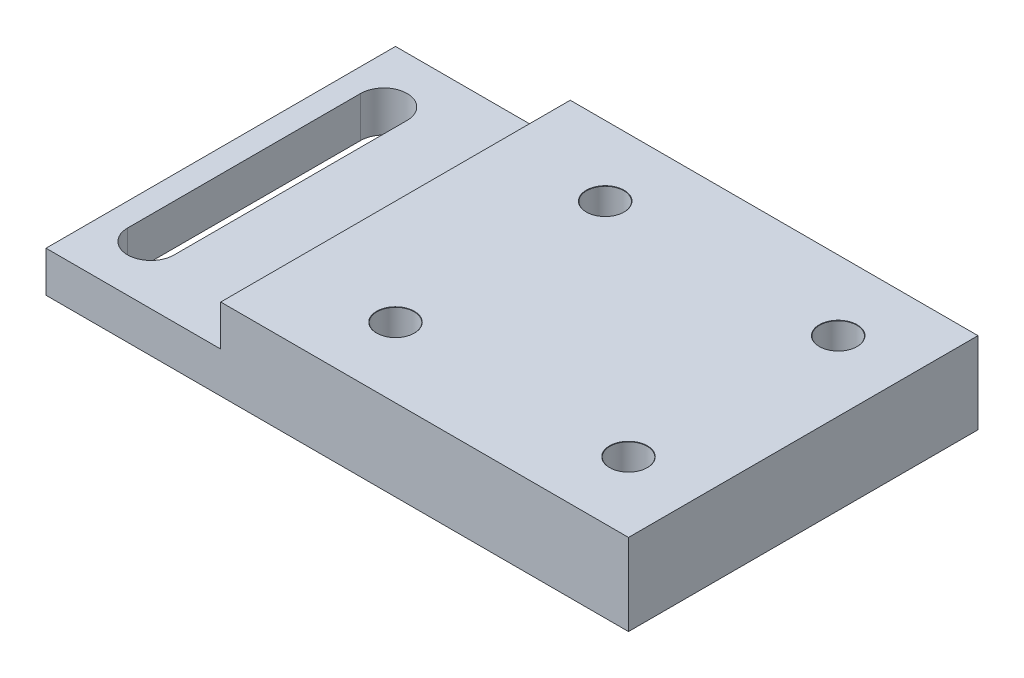
ISO-10303-21;
HEADER;
FILE_DESCRIPTION(('STEP AP214'),'2;1');
FILE_NAME('part.step','',(''),(''),'','','');
FILE_SCHEMA(('AUTOMOTIVE_DESIGN { 1 0 10303 214 1 1 1 1 }'));
ENDSEC;
DATA;
#1=APPLICATION_CONTEXT('core data for automotive mechanical design processes');
#2=APPLICATION_PROTOCOL_DEFINITION('international standard','automotive_design',2000,#1);
#3=PRODUCT_CONTEXT('',#1,'mechanical');
#4=PRODUCT('Part','Part','',(#3));
#5=PRODUCT_RELATED_PRODUCT_CATEGORY('part','',(#4));
#6=PRODUCT_DEFINITION_FORMATION('','',#4);
#7=PRODUCT_DEFINITION_CONTEXT('part definition',#1,'design');
#8=PRODUCT_DEFINITION('design','',#6,#7);
#9=PRODUCT_DEFINITION_SHAPE('','',#8);
#10=(LENGTH_UNIT() NAMED_UNIT(*) SI_UNIT(.MILLI.,.METRE.));
#11=(NAMED_UNIT(*) PLANE_ANGLE_UNIT() SI_UNIT($,.RADIAN.));
#12=(NAMED_UNIT(*) SI_UNIT($,.STERADIAN.) SOLID_ANGLE_UNIT());
#13=UNCERTAINTY_MEASURE_WITH_UNIT(LENGTH_MEASURE(1.E-05),#10,'distance_accuracy_value','');
#14=(GEOMETRIC_REPRESENTATION_CONTEXT(3) GLOBAL_UNCERTAINTY_ASSIGNED_CONTEXT((#13)) GLOBAL_UNIT_ASSIGNED_CONTEXT((#10,
#11,#12)) REPRESENTATION_CONTEXT('',''));
#15=CARTESIAN_POINT('',(0.,0.,0.));
#16=DIRECTION('',(0.,0.,1.));
#17=DIRECTION('',(1.,0.,0.));
#18=AXIS2_PLACEMENT_3D('',#15,#16,#17);
#19=CARTESIAN_POINT('',(25.,7.,15.));
#20=DIRECTION('',(-1.,0.,0.));
#21=DIRECTION('',(0.,0.,1.));
#22=AXIS2_PLACEMENT_3D('',#19,#20,#21);
#23=PLANE('',#22);
#24=DIRECTION('',(0.,0.,-1.));
#25=VECTOR('',#24,1.);
#26=CARTESIAN_POINT('',(25.,0.,15.));
#27=LINE('',#26,#25);
#28=CARTESIAN_POINT('',(25.,0.,15.));
#29=VERTEX_POINT('',#28);
#30=CARTESIAN_POINT('',(25.,0.,-15.));
#31=VERTEX_POINT('',#30);
#32=EDGE_CURVE('E188',#29,#31,#27,.T.);
#33=ORIENTED_EDGE('',*,*,#32,.T.);
#34=DIRECTION('',(0.,-1.,0.));
#35=VECTOR('',#34,1.);
#36=CARTESIAN_POINT('',(25.,7.,-15.));
#37=LINE('',#36,#35);
#38=CARTESIAN_POINT('',(25.,7.,-15.));
#39=VERTEX_POINT('',#38);
#40=EDGE_CURVE('E11',#39,#31,#37,.T.);
#41=ORIENTED_EDGE('',*,*,#40,.F.);
#42=DIRECTION('',(0.,0.,-1.));
#43=VECTOR('',#42,1.);
#44=CARTESIAN_POINT('',(25.,7.,15.));
#45=LINE('',#44,#43);
#46=CARTESIAN_POINT('',(25.,7.,15.));
#47=VERTEX_POINT('',#46);
#48=EDGE_CURVE('E191',#47,#39,#45,.T.);
#49=ORIENTED_EDGE('',*,*,#48,.F.);
#50=DIRECTION('',(0.,-1.,0.));
#51=VECTOR('',#50,1.);
#52=CARTESIAN_POINT('',(25.,7.,15.));
#53=LINE('',#52,#51);
#54=EDGE_CURVE('E203',#47,#29,#53,.T.);
#55=ORIENTED_EDGE('',*,*,#54,.T.);
#56=EDGE_LOOP('',(#33,#41,#49,#55));
#57=FACE_BOUND('',#56,.T.);
#58=ADVANCED_FACE('F38',(#57),#23,.F.);
#59=CARTESIAN_POINT('',(-25.,7.,-15.));
#60=DIRECTION('',(0.,0.,1.));
#61=DIRECTION('',(1.,0.,0.));
#62=AXIS2_PLACEMENT_3D('',#59,#60,#61);
#63=PLANE('',#62);
#64=DIRECTION('',(-1.,0.,0.));
#65=VECTOR('',#64,1.);
#66=CARTESIAN_POINT('',(-25.,3.5,-15.));
#67=LINE('',#66,#65);
#68=CARTESIAN_POINT('',(-10.,3.5,-15.));
#69=VERTEX_POINT('',#68);
#70=CARTESIAN_POINT('',(-25.,3.5,-15.));
#71=VERTEX_POINT('',#70);
#72=EDGE_CURVE('E178',#69,#71,#67,.T.);
#73=ORIENTED_EDGE('',*,*,#72,.F.);
#74=DIRECTION('',(0.,1.,0.));
#75=VECTOR('',#74,1.);
#76=CARTESIAN_POINT('',(-10.,3.5,-15.));
#77=LINE('',#76,#75);
#78=CARTESIAN_POINT('',(-10.,7.,-15.));
#79=VERTEX_POINT('',#78);
#80=EDGE_CURVE('E184',#69,#79,#77,.T.);
#81=ORIENTED_EDGE('',*,*,#80,.T.);
#82=DIRECTION('',(-1.,0.,0.));
#83=VECTOR('',#82,1.);
#84=CARTESIAN_POINT('',(-25.,7.,-15.));
#85=LINE('',#84,#83);
#86=EDGE_CURVE('E195',#39,#79,#85,.T.);
#87=ORIENTED_EDGE('',*,*,#86,.F.);
#88=ORIENTED_EDGE('',*,*,#40,.T.);
#89=DIRECTION('',(-1.,0.,0.));
#90=VECTOR('',#89,1.);
#91=CARTESIAN_POINT('',(-25.,0.,-15.));
#92=LINE('',#91,#90);
#93=CARTESIAN_POINT('',(-25.,0.,-15.));
#94=VERTEX_POINT('',#93);
#95=EDGE_CURVE('E207',#31,#94,#92,.T.);
#96=ORIENTED_EDGE('',*,*,#95,.T.);
#97=DIRECTION('',(0.,-1.,0.));
#98=VECTOR('',#97,1.);
#99=CARTESIAN_POINT('',(-25.,7.,-15.));
#100=LINE('',#99,#98);
#101=EDGE_CURVE('E46',#71,#94,#100,.T.);
#102=ORIENTED_EDGE('',*,*,#101,.F.);
#103=EDGE_LOOP('',(#73,#81,#87,#88,#96,#102));
#104=FACE_BOUND('',#103,.T.);
#105=ADVANCED_FACE('F232',(#104),#63,.F.);
#106=CARTESIAN_POINT('',(-25.,7.,15.));
#107=DIRECTION('',(1.,0.,0.));
#108=DIRECTION('',(0.,0.,-1.));
#109=AXIS2_PLACEMENT_3D('',#106,#107,#108);
#110=PLANE('',#109);
#111=DIRECTION('',(0.,-1.,0.));
#112=VECTOR('',#111,1.);
#113=CARTESIAN_POINT('',(-25.,7.,15.));
#114=LINE('',#113,#112);
#115=CARTESIAN_POINT('',(-25.,3.5,15.));
#116=VERTEX_POINT('',#115);
#117=CARTESIAN_POINT('',(-25.,0.,15.));
#118=VERTEX_POINT('',#117);
#119=EDGE_CURVE('E220',#116,#118,#114,.T.);
#120=ORIENTED_EDGE('',*,*,#119,.F.);
#121=DIRECTION('',(0.,0.,1.));
#122=VECTOR('',#121,1.);
#123=CARTESIAN_POINT('',(-25.,3.5,15.));
#124=LINE('',#123,#122);
#125=EDGE_CURVE('E167',#71,#116,#124,.T.);
#126=ORIENTED_EDGE('',*,*,#125,.F.);
#127=ORIENTED_EDGE('',*,*,#101,.T.);
#128=DIRECTION('',(0.,0.,1.));
#129=VECTOR('',#128,1.);
#130=CARTESIAN_POINT('',(-25.,0.,15.));
#131=LINE('',#130,#129);
#132=EDGE_CURVE('E211',#94,#118,#131,.T.);
#133=ORIENTED_EDGE('',*,*,#132,.T.);
#134=EDGE_LOOP('',(#120,#126,#127,#133));
#135=FACE_BOUND('',#134,.T.);
#136=ADVANCED_FACE('F227',(#135),#110,.F.);
#137=CARTESIAN_POINT('',(-25.,7.,15.));
#138=DIRECTION('',(0.,0.,-1.));
#139=DIRECTION('',(-1.,0.,0.));
#140=AXIS2_PLACEMENT_3D('',#137,#138,#139);
#141=PLANE('',#140);
#142=DIRECTION('',(1.,0.,0.));
#143=VECTOR('',#142,1.);
#144=CARTESIAN_POINT('',(-25.,7.,15.));
#145=LINE('',#144,#143);
#146=CARTESIAN_POINT('',(-10.,7.,15.));
#147=VERTEX_POINT('',#146);
#148=EDGE_CURVE('E200',#147,#47,#145,.T.);
#149=ORIENTED_EDGE('',*,*,#148,.F.);
#150=DIRECTION('',(0.,1.,0.));
#151=VECTOR('',#150,1.);
#152=CARTESIAN_POINT('',(-10.,3.5,15.));
#153=LINE('',#152,#151);
#154=CARTESIAN_POINT('',(-10.,3.5,15.));
#155=VERTEX_POINT('',#154);
#156=EDGE_CURVE('E181',#155,#147,#153,.T.);
#157=ORIENTED_EDGE('',*,*,#156,.F.);
#158=DIRECTION('',(1.,0.,0.));
#159=VECTOR('',#158,1.);
#160=CARTESIAN_POINT('',(-25.,3.5,15.));
#161=LINE('',#160,#159);
#162=EDGE_CURVE('E170',#116,#155,#161,.T.);
#163=ORIENTED_EDGE('',*,*,#162,.F.);
#164=ORIENTED_EDGE('',*,*,#119,.T.);
#165=DIRECTION('',(1.,0.,0.));
#166=VECTOR('',#165,1.);
#167=CARTESIAN_POINT('',(-25.,0.,15.));
#168=LINE('',#167,#166);
#169=EDGE_CURVE('E196',#118,#29,#168,.T.);
#170=ORIENTED_EDGE('',*,*,#169,.T.);
#171=ORIENTED_EDGE('',*,*,#54,.F.);
#172=EDGE_LOOP('',(#149,#157,#163,#164,#170,#171));
#173=FACE_BOUND('',#172,.T.);
#174=ADVANCED_FACE('F238',(#173),#141,.F.);
#175=CARTESIAN_POINT('',(0.,7.,0.));
#176=DIRECTION('',(0.,-1.,0.));
#177=DIRECTION('',(0.,0.,-1.));
#178=AXIS2_PLACEMENT_3D('',#175,#176,#177);
#179=PLANE('',#178);
#180=CARTESIAN_POINT('',(-0.999999999999997,7.,-9.));
#181=DIRECTION('',(0.,1.,0.));
#182=DIRECTION('',(0.,0.,1.));
#183=AXIS2_PLACEMENT_3D('',#180,#181,#182);
#184=CIRCLE('',#183,1.625);
#185=CARTESIAN_POINT('',(-0.999999999999997,7.,-7.375));
#186=VERTEX_POINT('',#185);
#187=EDGE_CURVE('E282',#186,#186,#184,.T.);
#188=ORIENTED_EDGE('',*,*,#187,.F.);
#189=EDGE_LOOP('',(#188));
#190=FACE_BOUND('',#189,.T.);
#191=CARTESIAN_POINT('',(-0.999999999999997,7.,9.));
#192=DIRECTION('',(0.,1.,0.));
#193=DIRECTION('',(0.,0.,1.));
#194=AXIS2_PLACEMENT_3D('',#191,#192,#193);
#195=CIRCLE('',#194,1.625);
#196=CARTESIAN_POINT('',(-0.999999999999997,7.,10.625));
#197=VERTEX_POINT('',#196);
#198=EDGE_CURVE('E286',#197,#197,#195,.T.);
#199=ORIENTED_EDGE('',*,*,#198,.F.);
#200=EDGE_LOOP('',(#199));
#201=FACE_BOUND('',#200,.T.);
#202=CARTESIAN_POINT('',(19.,7.,-9.));
#203=DIRECTION('',(0.,1.,0.));
#204=DIRECTION('',(0.,0.,1.));
#205=AXIS2_PLACEMENT_3D('',#202,#203,#204);
#206=CIRCLE('',#205,1.625);
#207=CARTESIAN_POINT('',(19.,7.,-7.375));
#208=VERTEX_POINT('',#207);
#209=EDGE_CURVE('E290',#208,#208,#206,.T.);
#210=ORIENTED_EDGE('',*,*,#209,.F.);
#211=EDGE_LOOP('',(#210));
#212=FACE_BOUND('',#211,.T.);
#213=CARTESIAN_POINT('',(19.,7.,9.));
#214=DIRECTION('',(0.,1.,0.));
#215=DIRECTION('',(0.,0.,1.));
#216=AXIS2_PLACEMENT_3D('',#213,#214,#215);
#217=CIRCLE('',#216,1.625);
#218=CARTESIAN_POINT('',(19.,7.,10.625));
#219=VERTEX_POINT('',#218);
#220=EDGE_CURVE('E293',#219,#219,#217,.T.);
#221=ORIENTED_EDGE('',*,*,#220,.F.);
#222=EDGE_LOOP('',(#221));
#223=FACE_BOUND('',#222,.T.);
#224=ORIENTED_EDGE('',*,*,#86,.T.);
#225=DIRECTION('',(0.,0.,-1.));
#226=VECTOR('',#225,1.);
#227=CARTESIAN_POINT('',(-10.,7.,15.));
#228=LINE('',#227,#226);
#229=EDGE_CURVE('E161',#147,#79,#228,.T.);
#230=ORIENTED_EDGE('',*,*,#229,.F.);
#231=ORIENTED_EDGE('',*,*,#148,.T.);
#232=ORIENTED_EDGE('',*,*,#48,.T.);
#233=EDGE_LOOP('',(#224,#230,#231,#232));
#234=FACE_BOUND('',#233,.T.);
#235=ADVANCED_FACE('F243',(#190,#201,#212,#223,#234),#179,.F.);
#236=CARTESIAN_POINT('',(0.,0.,0.));
#237=DIRECTION('',(0.,-1.,0.));
#238=DIRECTION('',(0.,0.,-1.));
#239=AXIS2_PLACEMENT_3D('',#236,#237,#238);
#240=PLANE('',#239);
#241=CARTESIAN_POINT('',(-0.999999999999997,0.,-9.));
#242=DIRECTION('',(0.,1.,0.));
#243=DIRECTION('',(0.,0.,1.));
#244=AXIS2_PLACEMENT_3D('',#241,#242,#243);
#245=CIRCLE('',#244,1.6);
#246=CARTESIAN_POINT('',(-0.999999999999997,0.,-7.4));
#247=VERTEX_POINT('',#246);
#248=EDGE_CURVE('E321',#247,#247,#245,.T.);
#249=ORIENTED_EDGE('',*,*,#248,.T.);
#250=EDGE_LOOP('',(#249));
#251=FACE_BOUND('',#250,.T.);
#252=CARTESIAN_POINT('',(-0.999999999999997,0.,9.));
#253=DIRECTION('',(0.,1.,0.));
#254=DIRECTION('',(0.,0.,1.));
#255=AXIS2_PLACEMENT_3D('',#252,#253,#254);
#256=CIRCLE('',#255,1.6);
#257=CARTESIAN_POINT('',(-0.999999999999997,0.,10.6));
#258=VERTEX_POINT('',#257);
#259=EDGE_CURVE('E311',#258,#258,#256,.T.);
#260=ORIENTED_EDGE('',*,*,#259,.T.);
#261=EDGE_LOOP('',(#260));
#262=FACE_BOUND('',#261,.T.);
#263=CARTESIAN_POINT('',(19.,0.,-9.));
#264=DIRECTION('',(0.,1.,0.));
#265=DIRECTION('',(0.,0.,1.));
#266=AXIS2_PLACEMENT_3D('',#263,#264,#265);
#267=CIRCLE('',#266,1.6);
#268=CARTESIAN_POINT('',(19.,0.,-7.4));
#269=VERTEX_POINT('',#268);
#270=EDGE_CURVE('E297',#269,#269,#267,.T.);
#271=ORIENTED_EDGE('',*,*,#270,.T.);
#272=EDGE_LOOP('',(#271));
#273=FACE_BOUND('',#272,.T.);
#274=CARTESIAN_POINT('',(19.,0.,9.));
#275=DIRECTION('',(0.,1.,0.));
#276=DIRECTION('',(0.,0.,1.));
#277=AXIS2_PLACEMENT_3D('',#274,#275,#276);
#278=CIRCLE('',#277,1.6);
#279=CARTESIAN_POINT('',(19.,0.,10.6));
#280=VERTEX_POINT('',#279);
#281=EDGE_CURVE('E143',#280,#280,#278,.T.);
#282=ORIENTED_EDGE('',*,*,#281,.T.);
#283=EDGE_LOOP('',(#282));
#284=FACE_BOUND('',#283,.T.);
#285=CARTESIAN_POINT('',(-21.,0.,-10.));
#286=DIRECTION('',(0.,1.,0.));
#287=DIRECTION('',(0.,0.,1.));
#288=AXIS2_PLACEMENT_3D('',#285,#286,#287);
#289=CIRCLE('',#288,2.);
#290=CARTESIAN_POINT('',(-19.,0.,-10.));
#291=VERTEX_POINT('',#290);
#292=CARTESIAN_POINT('',(-23.,0.,-10.));
#293=VERTEX_POINT('',#292);
#294=EDGE_CURVE('E117',#291,#293,#289,.T.);
#295=ORIENTED_EDGE('',*,*,#294,.T.);
#296=DIRECTION('',(0.,0.,1.));
#297=VECTOR('',#296,1.);
#298=CARTESIAN_POINT('',(-23.,0.,-10.));
#299=LINE('',#298,#297);
#300=CARTESIAN_POINT('',(-23.,0.,10.));
#301=VERTEX_POINT('',#300);
#302=EDGE_CURVE('E127',#293,#301,#299,.T.);
#303=ORIENTED_EDGE('',*,*,#302,.T.);
#304=CARTESIAN_POINT('',(-21.,0.,10.));
#305=DIRECTION('',(0.,1.,0.));
#306=DIRECTION('',(0.,0.,1.));
#307=AXIS2_PLACEMENT_3D('',#304,#305,#306);
#308=CIRCLE('',#307,2.);
#309=CARTESIAN_POINT('',(-19.,0.,10.));
#310=VERTEX_POINT('',#309);
#311=EDGE_CURVE('E53',#301,#310,#308,.T.);
#312=ORIENTED_EDGE('',*,*,#311,.T.);
#313=DIRECTION('',(0.,0.,-1.));
#314=VECTOR('',#313,1.);
#315=CARTESIAN_POINT('',(-19.,0.,-10.));
#316=LINE('',#315,#314);
#317=EDGE_CURVE('E124',#310,#291,#316,.T.);
#318=ORIENTED_EDGE('',*,*,#317,.T.);
#319=EDGE_LOOP('',(#295,#303,#312,#318));
#320=FACE_BOUND('',#319,.T.);
#321=ORIENTED_EDGE('',*,*,#32,.F.);
#322=ORIENTED_EDGE('',*,*,#169,.F.);
#323=ORIENTED_EDGE('',*,*,#132,.F.);
#324=ORIENTED_EDGE('',*,*,#95,.F.);
#325=EDGE_LOOP('',(#321,#322,#323,#324));
#326=FACE_BOUND('',#325,.T.);
#327=ADVANCED_FACE('F132',(#251,#262,#273,#284,#320,#326),#240,.T.);
#328=CARTESIAN_POINT('',(-10.,3.5,15.));
#329=DIRECTION('',(1.,0.,0.));
#330=DIRECTION('',(0.,0.,-1.));
#331=AXIS2_PLACEMENT_3D('',#328,#329,#330);
#332=PLANE('',#331);
#333=ORIENTED_EDGE('',*,*,#229,.T.);
#334=ORIENTED_EDGE('',*,*,#80,.F.);
#335=DIRECTION('',(0.,0.,-1.));
#336=VECTOR('',#335,1.);
#337=CARTESIAN_POINT('',(-10.,3.5,15.));
#338=LINE('',#337,#336);
#339=EDGE_CURVE('E174',#155,#69,#338,.T.);
#340=ORIENTED_EDGE('',*,*,#339,.F.);
#341=ORIENTED_EDGE('',*,*,#156,.T.);
#342=EDGE_LOOP('',(#333,#334,#340,#341));
#343=FACE_BOUND('',#342,.T.);
#344=ADVANCED_FACE('F247',(#343),#332,.F.);
#345=CARTESIAN_POINT('',(0.,3.5,0.));
#346=DIRECTION('',(0.,-1.,0.));
#347=DIRECTION('',(0.,0.,-1.));
#348=AXIS2_PLACEMENT_3D('',#345,#346,#347);
#349=PLANE('',#348);
#350=DIRECTION('',(0.,0.,1.));
#351=VECTOR('',#350,1.);
#352=CARTESIAN_POINT('',(-23.,3.5,-10.));
#353=LINE('',#352,#351);
#354=CARTESIAN_POINT('',(-23.,3.5,-10.));
#355=VERTEX_POINT('',#354);
#356=CARTESIAN_POINT('',(-23.,3.5,10.));
#357=VERTEX_POINT('',#356);
#358=EDGE_CURVE('E152',#355,#357,#353,.T.);
#359=ORIENTED_EDGE('',*,*,#358,.F.);
#360=CARTESIAN_POINT('',(-21.,3.5,-10.));
#361=DIRECTION('',(0.,1.,0.));
#362=DIRECTION('',(0.,0.,1.));
#363=AXIS2_PLACEMENT_3D('',#360,#361,#362);
#364=CIRCLE('',#363,2.);
#365=CARTESIAN_POINT('',(-19.,3.5,-10.));
#366=VERTEX_POINT('',#365);
#367=EDGE_CURVE('E61',#366,#355,#364,.T.);
#368=ORIENTED_EDGE('',*,*,#367,.F.);
#369=DIRECTION('',(0.,0.,-1.));
#370=VECTOR('',#369,1.);
#371=CARTESIAN_POINT('',(-19.,3.5,-10.));
#372=LINE('',#371,#370);
#373=CARTESIAN_POINT('',(-19.,3.5,10.));
#374=VERTEX_POINT('',#373);
#375=EDGE_CURVE('E136',#374,#366,#372,.T.);
#376=ORIENTED_EDGE('',*,*,#375,.F.);
#377=CARTESIAN_POINT('',(-21.,3.5,10.));
#378=DIRECTION('',(0.,1.,0.));
#379=DIRECTION('',(0.,0.,1.));
#380=AXIS2_PLACEMENT_3D('',#377,#378,#379);
#381=CIRCLE('',#380,2.);
#382=EDGE_CURVE('E140',#357,#374,#381,.T.);
#383=ORIENTED_EDGE('',*,*,#382,.F.);
#384=EDGE_LOOP('',(#359,#368,#376,#383));
#385=FACE_BOUND('',#384,.T.);
#386=ORIENTED_EDGE('',*,*,#125,.T.);
#387=ORIENTED_EDGE('',*,*,#162,.T.);
#388=ORIENTED_EDGE('',*,*,#339,.T.);
#389=ORIENTED_EDGE('',*,*,#72,.T.);
#390=EDGE_LOOP('',(#386,#387,#388,#389));
#391=FACE_BOUND('',#390,.T.);
#392=ADVANCED_FACE('F249',(#385,#391),#349,.F.);
#393=CARTESIAN_POINT('',(-21.,0.,-10.));
#394=DIRECTION('',(0.,1.,0.));
#395=DIRECTION('',(0.,0.,1.));
#396=AXIS2_PLACEMENT_3D('',#393,#394,#395);
#397=CYLINDRICAL_SURFACE('',#396,2.);
#398=ORIENTED_EDGE('',*,*,#367,.T.);
#399=DIRECTION('',(0.,1.,0.));
#400=VECTOR('',#399,1.);
#401=CARTESIAN_POINT('',(-23.,0.,-10.));
#402=LINE('',#401,#400);
#403=EDGE_CURVE('E113',#293,#355,#402,.T.);
#404=ORIENTED_EDGE('',*,*,#403,.F.);
#405=ORIENTED_EDGE('',*,*,#294,.F.);
#406=DIRECTION('',(0.,1.,0.));
#407=VECTOR('',#406,1.);
#408=CARTESIAN_POINT('',(-19.,0.,-10.));
#409=LINE('',#408,#407);
#410=EDGE_CURVE('E158',#291,#366,#409,.T.);
#411=ORIENTED_EDGE('',*,*,#410,.T.);
#412=EDGE_LOOP('',(#398,#404,#405,#411));
#413=FACE_BOUND('',#412,.T.);
#414=ADVANCED_FACE('F115',(#413),#397,.F.);
#415=CARTESIAN_POINT('',(-19.,0.,-10.));
#416=DIRECTION('',(1.,0.,0.));
#417=DIRECTION('',(0.,0.,-1.));
#418=AXIS2_PLACEMENT_3D('',#415,#416,#417);
#419=PLANE('',#418);
#420=ORIENTED_EDGE('',*,*,#375,.T.);
#421=ORIENTED_EDGE('',*,*,#410,.F.);
#422=ORIENTED_EDGE('',*,*,#317,.F.);
#423=DIRECTION('',(0.,1.,0.));
#424=VECTOR('',#423,1.);
#425=CARTESIAN_POINT('',(-19.,0.,10.));
#426=LINE('',#425,#424);
#427=EDGE_CURVE('E162',#310,#374,#426,.T.);
#428=ORIENTED_EDGE('',*,*,#427,.T.);
#429=EDGE_LOOP('',(#420,#421,#422,#428));
#430=FACE_BOUND('',#429,.T.);
#431=ADVANCED_FACE('F257',(#430),#419,.F.);
#432=CARTESIAN_POINT('',(-21.,0.,10.));
#433=DIRECTION('',(0.,1.,0.));
#434=DIRECTION('',(0.,0.,1.));
#435=AXIS2_PLACEMENT_3D('',#432,#433,#434);
#436=CYLINDRICAL_SURFACE('',#435,2.);
#437=ORIENTED_EDGE('',*,*,#382,.T.);
#438=ORIENTED_EDGE('',*,*,#427,.F.);
#439=ORIENTED_EDGE('',*,*,#311,.F.);
#440=DIRECTION('',(0.,1.,0.));
#441=VECTOR('',#440,1.);
#442=CARTESIAN_POINT('',(-23.,0.,10.));
#443=LINE('',#442,#441);
#444=EDGE_CURVE('E123',#301,#357,#443,.T.);
#445=ORIENTED_EDGE('',*,*,#444,.T.);
#446=EDGE_LOOP('',(#437,#438,#439,#445));
#447=FACE_BOUND('',#446,.T.);
#448=ADVANCED_FACE('F369',(#447),#436,.F.);
#449=CARTESIAN_POINT('',(-23.,0.,-10.));
#450=DIRECTION('',(-1.,0.,0.));
#451=DIRECTION('',(0.,0.,1.));
#452=AXIS2_PLACEMENT_3D('',#449,#450,#451);
#453=PLANE('',#452);
#454=ORIENTED_EDGE('',*,*,#358,.T.);
#455=ORIENTED_EDGE('',*,*,#444,.F.);
#456=ORIENTED_EDGE('',*,*,#302,.F.);
#457=ORIENTED_EDGE('',*,*,#403,.T.);
#458=EDGE_LOOP('',(#454,#455,#456,#457));
#459=FACE_BOUND('',#458,.T.);
#460=ADVANCED_FACE('F128',(#459),#453,.F.);
#461=CARTESIAN_POINT('',(19.,7.,9.));
#462=DIRECTION('',(0.,1.,0.));
#463=DIRECTION('',(0.,0.,1.));
#464=AXIS2_PLACEMENT_3D('',#461,#462,#463);
#465=CYLINDRICAL_SURFACE('',#464,1.6);
#466=ORIENTED_EDGE('',*,*,#281,.F.);
#467=EDGE_LOOP('',(#466));
#468=FACE_BOUND('',#467,.T.);
#469=CARTESIAN_POINT('',(19.,6.97499999999999,9.));
#470=DIRECTION('',(0.,1.,0.));
#471=DIRECTION('',(0.,0.,1.));
#472=AXIS2_PLACEMENT_3D('',#469,#470,#471);
#473=CIRCLE('',#472,1.6);
#474=CARTESIAN_POINT('',(19.,6.97499999999999,10.6));
#475=VERTEX_POINT('',#474);
#476=EDGE_CURVE('E296',#475,#475,#473,.T.);
#477=ORIENTED_EDGE('',*,*,#476,.T.);
#478=EDGE_LOOP('',(#477));
#479=FACE_BOUND('',#478,.T.);
#480=ADVANCED_FACE('F362',(#468,#479),#465,.F.);
#481=CARTESIAN_POINT('',(19.,7.,9.));
#482=DIRECTION('',(0.,1.,0.));
#483=DIRECTION('',(0.,0.,1.));
#484=AXIS2_PLACEMENT_3D('',#481,#482,#483);
#485=CONICAL_SURFACE('',#484,1.625,0.785398163397344);
#486=ORIENTED_EDGE('',*,*,#476,.F.);
#487=EDGE_LOOP('',(#486));
#488=FACE_BOUND('',#487,.T.);
#489=ORIENTED_EDGE('',*,*,#220,.T.);
#490=EDGE_LOOP('',(#489));
#491=FACE_BOUND('',#490,.T.);
#492=ADVANCED_FACE('F358',(#488,#491),#485,.F.);
#493=CARTESIAN_POINT('',(19.,7.,-9.));
#494=DIRECTION('',(0.,1.,0.));
#495=DIRECTION('',(0.,0.,1.));
#496=AXIS2_PLACEMENT_3D('',#493,#494,#495);
#497=CYLINDRICAL_SURFACE('',#496,1.6);
#498=ORIENTED_EDGE('',*,*,#270,.F.);
#499=EDGE_LOOP('',(#498));
#500=FACE_BOUND('',#499,.T.);
#501=CARTESIAN_POINT('',(19.,6.97499999999999,-9.));
#502=DIRECTION('',(0.,1.,0.));
#503=DIRECTION('',(0.,0.,1.));
#504=AXIS2_PLACEMENT_3D('',#501,#502,#503);
#505=CIRCLE('',#504,1.6);
#506=CARTESIAN_POINT('',(19.,6.97499999999999,-7.4));
#507=VERTEX_POINT('',#506);
#508=EDGE_CURVE('E303',#507,#507,#505,.T.);
#509=ORIENTED_EDGE('',*,*,#508,.T.);
#510=EDGE_LOOP('',(#509));
#511=FACE_BOUND('',#510,.T.);
#512=ADVANCED_FACE('F354',(#500,#511),#497,.F.);
#513=CARTESIAN_POINT('',(19.,7.,-9.));
#514=DIRECTION('',(0.,1.,0.));
#515=DIRECTION('',(0.,0.,1.));
#516=AXIS2_PLACEMENT_3D('',#513,#514,#515);
#517=CONICAL_SURFACE('',#516,1.625,0.785398163397344);
#518=ORIENTED_EDGE('',*,*,#508,.F.);
#519=EDGE_LOOP('',(#518));
#520=FACE_BOUND('',#519,.T.);
#521=ORIENTED_EDGE('',*,*,#209,.T.);
#522=EDGE_LOOP('',(#521));
#523=FACE_BOUND('',#522,.T.);
#524=ADVANCED_FACE('F350',(#520,#523),#517,.F.);
#525=CARTESIAN_POINT('',(-0.999999999999997,7.,9.));
#526=DIRECTION('',(0.,1.,0.));
#527=DIRECTION('',(0.,0.,1.));
#528=AXIS2_PLACEMENT_3D('',#525,#526,#527);
#529=CYLINDRICAL_SURFACE('',#528,1.6);
#530=ORIENTED_EDGE('',*,*,#259,.F.);
#531=EDGE_LOOP('',(#530));
#532=FACE_BOUND('',#531,.T.);
#533=CARTESIAN_POINT('',(-0.999999999999997,6.97499999999999,9.));
#534=DIRECTION('',(0.,1.,0.));
#535=DIRECTION('',(0.,0.,1.));
#536=AXIS2_PLACEMENT_3D('',#533,#534,#535);
#537=CIRCLE('',#536,1.6);
#538=CARTESIAN_POINT('',(-0.999999999999997,6.97499999999999,10.6));
#539=VERTEX_POINT('',#538);
#540=EDGE_CURVE('E315',#539,#539,#537,.T.);
#541=ORIENTED_EDGE('',*,*,#540,.T.);
#542=EDGE_LOOP('',(#541));
#543=FACE_BOUND('',#542,.T.);
#544=ADVANCED_FACE('F346',(#532,#543),#529,.F.);
#545=CARTESIAN_POINT('',(-0.999999999999997,7.,9.));
#546=DIRECTION('',(0.,1.,0.));
#547=DIRECTION('',(0.,0.,1.));
#548=AXIS2_PLACEMENT_3D('',#545,#546,#547);
#549=CONICAL_SURFACE('',#548,1.625,0.785398163397327);
#550=ORIENTED_EDGE('',*,*,#540,.F.);
#551=EDGE_LOOP('',(#550));
#552=FACE_BOUND('',#551,.T.);
#553=ORIENTED_EDGE('',*,*,#198,.T.);
#554=EDGE_LOOP('',(#553));
#555=FACE_BOUND('',#554,.T.);
#556=ADVANCED_FACE('F339',(#552,#555),#549,.F.);
#557=CARTESIAN_POINT('',(-0.999999999999997,7.,-9.));
#558=DIRECTION('',(0.,1.,0.));
#559=DIRECTION('',(0.,0.,1.));
#560=AXIS2_PLACEMENT_3D('',#557,#558,#559);
#561=CYLINDRICAL_SURFACE('',#560,1.6);
#562=ORIENTED_EDGE('',*,*,#248,.F.);
#563=EDGE_LOOP('',(#562));
#564=FACE_BOUND('',#563,.T.);
#565=CARTESIAN_POINT('',(-0.999999999999997,6.97499999999999,-9.));
#566=DIRECTION('',(0.,1.,0.));
#567=DIRECTION('',(0.,0.,1.));
#568=AXIS2_PLACEMENT_3D('',#565,#566,#567);
#569=CIRCLE('',#568,1.6);
#570=CARTESIAN_POINT('',(-0.999999999999997,6.97499999999999,-7.4));
#571=VERTEX_POINT('',#570);
#572=EDGE_CURVE('E325',#571,#571,#569,.T.);
#573=ORIENTED_EDGE('',*,*,#572,.T.);
#574=EDGE_LOOP('',(#573));
#575=FACE_BOUND('',#574,.T.);
#576=ADVANCED_FACE('F333',(#564,#575),#561,.F.);
#577=CARTESIAN_POINT('',(-0.999999999999997,7.,-9.));
#578=DIRECTION('',(0.,1.,0.));
#579=DIRECTION('',(0.,0.,1.));
#580=AXIS2_PLACEMENT_3D('',#577,#578,#579);
#581=CONICAL_SURFACE('',#580,1.625,0.785398163397327);
#582=ORIENTED_EDGE('',*,*,#572,.F.);
#583=EDGE_LOOP('',(#582));
#584=FACE_BOUND('',#583,.T.);
#585=ORIENTED_EDGE('',*,*,#187,.T.);
#586=EDGE_LOOP('',(#585));
#587=FACE_BOUND('',#586,.T.);
#588=ADVANCED_FACE('F331',(#584,#587),#581,.F.);
#589=CLOSED_SHELL('',(#58,#105,#136,#174,#235,#327,#344,#392,#414,#431,#448,#460,#480,#492,#512,
#524,#544,#556,#576,#588));
#590=MANIFOLD_SOLID_BREP('B2',#589);
#591=ADVANCED_BREP_SHAPE_REPRESENTATION('',(#18,#590),#14);
#592=SHAPE_DEFINITION_REPRESENTATION(#9,#591);
ENDSEC;
END-ISO-10303-21;
